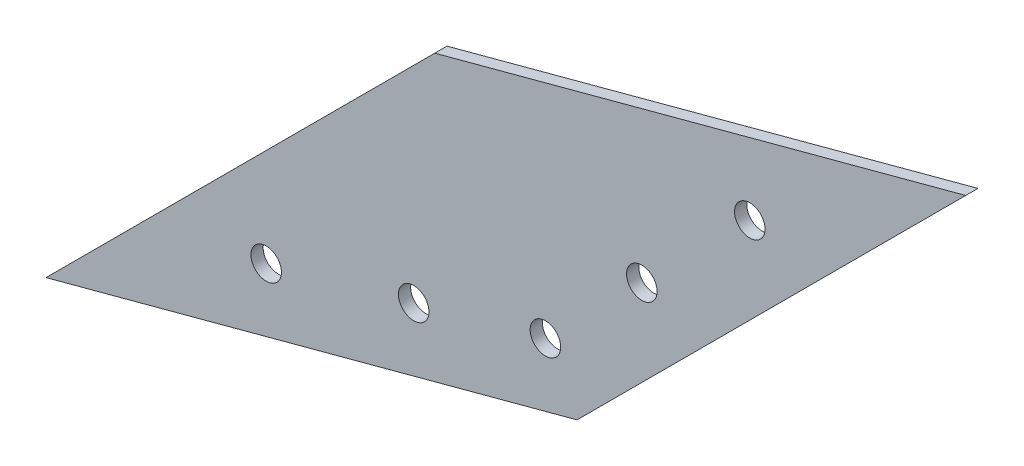
ISO-10303-21;
HEADER;
FILE_DESCRIPTION(('STEP AP214'),'2;1');
FILE_NAME('part.step','',(''),(''),'','','');
FILE_SCHEMA(('AUTOMOTIVE_DESIGN { 1 0 10303 214 1 1 1 1 }'));
ENDSEC;
DATA;
#1=APPLICATION_CONTEXT('core data for automotive mechanical design processes');
#2=APPLICATION_PROTOCOL_DEFINITION('international standard','automotive_design',2000,#1);
#3=PRODUCT_CONTEXT('',#1,'mechanical');
#4=PRODUCT('Part','Part','',(#3));
#5=PRODUCT_RELATED_PRODUCT_CATEGORY('part','',(#4));
#6=PRODUCT_DEFINITION_FORMATION('','',#4);
#7=PRODUCT_DEFINITION_CONTEXT('part definition',#1,'design');
#8=PRODUCT_DEFINITION('design','',#6,#7);
#9=PRODUCT_DEFINITION_SHAPE('','',#8);
#10=(LENGTH_UNIT() NAMED_UNIT(*) SI_UNIT(.MILLI.,.METRE.));
#11=(NAMED_UNIT(*) PLANE_ANGLE_UNIT() SI_UNIT($,.RADIAN.));
#12=(NAMED_UNIT(*) SI_UNIT($,.STERADIAN.) SOLID_ANGLE_UNIT());
#13=UNCERTAINTY_MEASURE_WITH_UNIT(LENGTH_MEASURE(1.E-05),#10,'distance_accuracy_value','');
#14=(GEOMETRIC_REPRESENTATION_CONTEXT(3) GLOBAL_UNCERTAINTY_ASSIGNED_CONTEXT((#13)) GLOBAL_UNIT_ASSIGNED_CONTEXT((#10,
#11,#12)) REPRESENTATION_CONTEXT('',''));
#15=CARTESIAN_POINT('',(0.,0.,0.));
#16=DIRECTION('',(0.,0.,1.));
#17=DIRECTION('',(1.,0.,0.));
#18=AXIS2_PLACEMENT_3D('',#15,#16,#17);
#19=CARTESIAN_POINT('',(0.,0.,2.));
#20=DIRECTION('',(-0.258819045102518,0.965925826289069,0.));
#21=DIRECTION('',(-0.965925826289069,-0.258819045102518,0.));
#22=AXIS2_PLACEMENT_3D('',#19,#20,#21);
#23=PLANE('',#22);
#24=DIRECTION('',(0.965925826289069,0.258819045102518,0.));
#25=VECTOR('',#24,1.);
#26=CARTESIAN_POINT('',(0.,0.,0.));
#27=LINE('',#26,#25);
#28=CARTESIAN_POINT('',(0.,0.,0.));
#29=VERTEX_POINT('',#28);
#30=CARTESIAN_POINT('',(86.9333243660162,23.2937140592266,0.));
#31=VERTEX_POINT('',#30);
#32=EDGE_CURVE('E97',#29,#31,#27,.T.);
#33=ORIENTED_EDGE('',*,*,#32,.T.);
#34=DIRECTION('',(0.,0.,-1.));
#35=VECTOR('',#34,1.);
#36=CARTESIAN_POINT('',(86.9333243660162,23.2937140592266,2.));
#37=LINE('',#36,#35);
#38=CARTESIAN_POINT('',(86.9333243660162,23.2937140592266,2.));
#39=VERTEX_POINT('',#38);
#40=EDGE_CURVE('E11',#39,#31,#37,.T.);
#41=ORIENTED_EDGE('',*,*,#40,.F.);
#42=DIRECTION('',(0.965925826289069,0.258819045102518,0.));
#43=VECTOR('',#42,1.);
#44=CARTESIAN_POINT('',(0.,0.,2.));
#45=LINE('',#44,#43);
#46=CARTESIAN_POINT('',(0.,0.,2.));
#47=VERTEX_POINT('',#46);
#48=EDGE_CURVE('E85',#47,#39,#45,.T.);
#49=ORIENTED_EDGE('',*,*,#48,.F.);
#50=DIRECTION('',(0.,0.,-1.));
#51=VECTOR('',#50,1.);
#52=CARTESIAN_POINT('',(0.,0.,2.));
#53=LINE('',#52,#51);
#54=EDGE_CURVE('E93',#47,#29,#53,.T.);
#55=ORIENTED_EDGE('',*,*,#54,.T.);
#56=EDGE_LOOP('',(#33,#41,#49,#55));
#57=FACE_BOUND('',#56,.T.);
#58=ADVANCED_FACE('F34',(#57),#23,.F.);
#59=CARTESIAN_POINT('',(86.9333243660162,23.2937140592266,2.));
#60=DIRECTION('',(-0.707106781186547,0.707106781186549,0.));
#61=DIRECTION('',(-0.707106781186549,-0.707106781186546,0.));
#62=AXIS2_PLACEMENT_3D('',#59,#60,#61);
#63=PLANE('',#62);
#64=DIRECTION('',(0.707106781186548,0.707106781186546,0.));
#65=VECTOR('',#64,1.);
#66=CARTESIAN_POINT('',(86.9333243660162,23.2937140592266,0.));
#67=LINE('',#66,#65);
#68=CARTESIAN_POINT('',(150.572934672806,86.9333243660158,0.));
#69=VERTEX_POINT('',#68);
#70=EDGE_CURVE('E89',#31,#69,#67,.T.);
#71=ORIENTED_EDGE('',*,*,#70,.T.);
#72=DIRECTION('',(0.,0.,-1.));
#73=VECTOR('',#72,1.);
#74=CARTESIAN_POINT('',(150.572934672806,86.9333243660158,2.));
#75=LINE('',#74,#73);
#76=CARTESIAN_POINT('',(150.572934672806,86.9333243660158,2.));
#77=VERTEX_POINT('',#76);
#78=EDGE_CURVE('E42',#77,#69,#75,.T.);
#79=ORIENTED_EDGE('',*,*,#78,.F.);
#80=DIRECTION('',(0.707106781186548,0.707106781186546,0.));
#81=VECTOR('',#80,1.);
#82=CARTESIAN_POINT('',(86.9333243660162,23.2937140592266,2.));
#83=LINE('',#82,#81);
#84=EDGE_CURVE('E80',#39,#77,#83,.T.);
#85=ORIENTED_EDGE('',*,*,#84,.F.);
#86=ORIENTED_EDGE('',*,*,#40,.T.);
#87=EDGE_LOOP('',(#71,#79,#85,#86));
#88=FACE_BOUND('',#87,.T.);
#89=ADVANCED_FACE('F88',(#88),#63,.F.);
#90=CARTESIAN_POINT('',(63.6396103067894,63.6396103067892,2.));
#91=DIRECTION('',(0.258819045102518,-0.965925826289069,0.));
#92=DIRECTION('',(0.965925826289069,0.258819045102518,0.));
#93=AXIS2_PLACEMENT_3D('',#90,#91,#92);
#94=PLANE('',#93);
#95=DIRECTION('',(-0.965925826289069,-0.258819045102518,0.));
#96=VECTOR('',#95,1.);
#97=CARTESIAN_POINT('',(63.6396103067894,63.6396103067892,0.));
#98=LINE('',#97,#96);
#99=CARTESIAN_POINT('',(63.6396103067894,63.6396103067892,0.));
#100=VERTEX_POINT('',#99);
#101=EDGE_CURVE('E67',#69,#100,#98,.T.);
#102=ORIENTED_EDGE('',*,*,#101,.T.);
#103=DIRECTION('',(0.,0.,-1.));
#104=VECTOR('',#103,1.);
#105=CARTESIAN_POINT('',(63.6396103067894,63.6396103067892,2.));
#106=LINE('',#105,#104);
#107=CARTESIAN_POINT('',(63.6396103067894,63.6396103067892,2.));
#108=VERTEX_POINT('',#107);
#109=EDGE_CURVE('E90',#108,#100,#106,.T.);
#110=ORIENTED_EDGE('',*,*,#109,.F.);
#111=DIRECTION('',(-0.965925826289069,-0.258819045102518,0.));
#112=VECTOR('',#111,1.);
#113=CARTESIAN_POINT('',(63.6396103067894,63.6396103067892,2.));
#114=LINE('',#113,#112);
#115=EDGE_CURVE('E83',#77,#108,#114,.T.);
#116=ORIENTED_EDGE('',*,*,#115,.F.);
#117=ORIENTED_EDGE('',*,*,#78,.T.);
#118=EDGE_LOOP('',(#102,#110,#116,#117));
#119=FACE_BOUND('',#118,.T.);
#120=ADVANCED_FACE('F91',(#119),#94,.F.);
#121=CARTESIAN_POINT('',(0.,0.,2.));
#122=DIRECTION('',(0.707106781186547,-0.707106781186548,0.));
#123=DIRECTION('',(0.707106781186548,0.707106781186547,0.));
#124=AXIS2_PLACEMENT_3D('',#121,#122,#123);
#125=PLANE('',#124);
#126=DIRECTION('',(-0.707106781186548,-0.707106781186547,0.));
#127=VECTOR('',#126,1.);
#128=CARTESIAN_POINT('',(0.,0.,0.));
#129=LINE('',#128,#127);
#130=EDGE_CURVE('E73',#100,#29,#129,.T.);
#131=ORIENTED_EDGE('',*,*,#130,.T.);
#132=ORIENTED_EDGE('',*,*,#54,.F.);
#133=DIRECTION('',(-0.707106781186548,-0.707106781186547,0.));
#134=VECTOR('',#133,1.);
#135=CARTESIAN_POINT('',(0.,0.,2.));
#136=LINE('',#135,#134);
#137=EDGE_CURVE('E50',#108,#47,#136,.T.);
#138=ORIENTED_EDGE('',*,*,#137,.F.);
#139=ORIENTED_EDGE('',*,*,#109,.T.);
#140=EDGE_LOOP('',(#131,#132,#138,#139));
#141=FACE_BOUND('',#140,.T.);
#142=ADVANCED_FACE('F105',(#141),#125,.F.);
#143=CARTESIAN_POINT('',(0.,0.,2.));
#144=DIRECTION('',(0.,0.,1.));
#145=DIRECTION('',(1.,0.,0.));
#146=AXIS2_PLACEMENT_3D('',#143,#144,#145);
#147=PLANE('',#146);
#148=CARTESIAN_POINT('',(81.7569434639658,32.2594687809072,2.));
#149=DIRECTION('',(0.,0.,1.));
#150=DIRECTION('',(1.,0.,0.));
#151=AXIS2_PLACEMENT_3D('',#148,#149,#150);
#152=CIRCLE('',#151,2.5);
#153=CARTESIAN_POINT('',(84.2569434639658,32.2594687809072,2.));
#154=VERTEX_POINT('',#153);
#155=EDGE_CURVE('E135',#154,#154,#152,.T.);
#156=ORIENTED_EDGE('',*,*,#155,.F.);
#157=EDGE_LOOP('',(#156));
#158=FACE_BOUND('',#157,.T.);
#159=CARTESIAN_POINT('',(36.0488426005376,20.0120200669914,2.));
#160=DIRECTION('',(0.,0.,1.));
#161=DIRECTION('',(1.,0.,0.));
#162=AXIS2_PLACEMENT_3D('',#159,#160,#161);
#163=CIRCLE('',#162,2.5);
#164=CARTESIAN_POINT('',(38.5488426005376,20.0120200669914,2.));
#165=VERTEX_POINT('',#164);
#166=EDGE_CURVE('E129',#165,#165,#163,.T.);
#167=ORIENTED_EDGE('',*,*,#166,.F.);
#168=EDGE_LOOP('',(#167));
#169=FACE_BOUND('',#168,.T.);
#170=CARTESIAN_POINT('',(60.1969882577643,26.4824961945544,2.));
#171=DIRECTION('',(0.,0.,1.));
#172=DIRECTION('',(1.,0.,0.));
#173=AXIS2_PLACEMENT_3D('',#170,#171,#172);
#174=CIRCLE('',#173,2.50000000000001);
#175=CARTESIAN_POINT('',(62.6969882577643,26.4824961945544,2.));
#176=VERTEX_POINT('',#175);
#177=EDGE_CURVE('E123',#176,#176,#174,.T.);
#178=ORIENTED_EDGE('',*,*,#177,.F.);
#179=EDGE_LOOP('',(#178));
#180=FACE_BOUND('',#179,.T.);
#181=CARTESIAN_POINT('',(97.5399260838144,48.0424514007558,2.));
#182=DIRECTION('',(0.,0.,1.));
#183=DIRECTION('',(1.,0.,0.));
#184=AXIS2_PLACEMENT_3D('',#181,#182,#183);
#185=CIRCLE('',#184,2.5);
#186=CARTESIAN_POINT('',(100.039926083814,48.0424514007558,2.));
#187=VERTEX_POINT('',#186);
#188=EDGE_CURVE('E117',#187,#187,#185,.T.);
#189=ORIENTED_EDGE('',*,*,#188,.F.);
#190=EDGE_LOOP('',(#189));
#191=FACE_BOUND('',#190,.T.);
#192=CARTESIAN_POINT('',(115.217595613478,65.7201209304195,2.));
#193=DIRECTION('',(0.,0.,1.));
#194=DIRECTION('',(1.,0.,0.));
#195=AXIS2_PLACEMENT_3D('',#192,#193,#194);
#196=CIRCLE('',#195,2.50000000000001);
#197=CARTESIAN_POINT('',(117.717595613478,65.7201209304195,2.));
#198=VERTEX_POINT('',#197);
#199=EDGE_CURVE('E111',#198,#198,#196,.T.);
#200=ORIENTED_EDGE('',*,*,#199,.F.);
#201=EDGE_LOOP('',(#200));
#202=FACE_BOUND('',#201,.T.);
#203=ORIENTED_EDGE('',*,*,#48,.T.);
#204=ORIENTED_EDGE('',*,*,#84,.T.);
#205=ORIENTED_EDGE('',*,*,#115,.T.);
#206=ORIENTED_EDGE('',*,*,#137,.T.);
#207=EDGE_LOOP('',(#203,#204,#205,#206));
#208=FACE_BOUND('',#207,.T.);
#209=ADVANCED_FACE('F81',(#158,#169,#180,#191,#202,#208),#147,.T.);
#210=CARTESIAN_POINT('',(0.,0.,0.));
#211=DIRECTION('',(0.,0.,1.));
#212=DIRECTION('',(1.,0.,0.));
#213=AXIS2_PLACEMENT_3D('',#210,#211,#212);
#214=PLANE('',#213);
#215=CARTESIAN_POINT('',(81.7569434639658,32.2594687809072,0.));
#216=DIRECTION('',(0.,0.,1.));
#217=DIRECTION('',(1.,0.,0.));
#218=AXIS2_PLACEMENT_3D('',#215,#216,#217);
#219=CIRCLE('',#218,2.5);
#220=CARTESIAN_POINT('',(84.2569434639658,32.2594687809072,0.));
#221=VERTEX_POINT('',#220);
#222=EDGE_CURVE('E132',#221,#221,#219,.T.);
#223=ORIENTED_EDGE('',*,*,#222,.T.);
#224=EDGE_LOOP('',(#223));
#225=FACE_BOUND('',#224,.T.);
#226=CARTESIAN_POINT('',(36.0488426005376,20.0120200669914,0.));
#227=DIRECTION('',(0.,0.,1.));
#228=DIRECTION('',(1.,0.,0.));
#229=AXIS2_PLACEMENT_3D('',#226,#227,#228);
#230=CIRCLE('',#229,2.5);
#231=CARTESIAN_POINT('',(38.5488426005376,20.0120200669914,0.));
#232=VERTEX_POINT('',#231);
#233=EDGE_CURVE('E126',#232,#232,#230,.T.);
#234=ORIENTED_EDGE('',*,*,#233,.T.);
#235=EDGE_LOOP('',(#234));
#236=FACE_BOUND('',#235,.T.);
#237=CARTESIAN_POINT('',(60.1969882577643,26.4824961945544,0.));
#238=DIRECTION('',(0.,0.,1.));
#239=DIRECTION('',(1.,0.,0.));
#240=AXIS2_PLACEMENT_3D('',#237,#238,#239);
#241=CIRCLE('',#240,2.50000000000001);
#242=CARTESIAN_POINT('',(62.6969882577643,26.4824961945544,0.));
#243=VERTEX_POINT('',#242);
#244=EDGE_CURVE('E120',#243,#243,#241,.T.);
#245=ORIENTED_EDGE('',*,*,#244,.T.);
#246=EDGE_LOOP('',(#245));
#247=FACE_BOUND('',#246,.T.);
#248=CARTESIAN_POINT('',(97.5399260838144,48.0424514007558,0.));
#249=DIRECTION('',(0.,0.,1.));
#250=DIRECTION('',(1.,0.,0.));
#251=AXIS2_PLACEMENT_3D('',#248,#249,#250);
#252=CIRCLE('',#251,2.5);
#253=CARTESIAN_POINT('',(100.039926083814,48.0424514007558,0.));
#254=VERTEX_POINT('',#253);
#255=EDGE_CURVE('E114',#254,#254,#252,.T.);
#256=ORIENTED_EDGE('',*,*,#255,.T.);
#257=EDGE_LOOP('',(#256));
#258=FACE_BOUND('',#257,.T.);
#259=CARTESIAN_POINT('',(115.217595613478,65.7201209304195,0.));
#260=DIRECTION('',(0.,0.,1.));
#261=DIRECTION('',(1.,0.,0.));
#262=AXIS2_PLACEMENT_3D('',#259,#260,#261);
#263=CIRCLE('',#262,2.50000000000001);
#264=CARTESIAN_POINT('',(117.717595613478,65.7201209304195,0.));
#265=VERTEX_POINT('',#264);
#266=EDGE_CURVE('E100',#265,#265,#263,.T.);
#267=ORIENTED_EDGE('',*,*,#266,.T.);
#268=EDGE_LOOP('',(#267));
#269=FACE_BOUND('',#268,.T.);
#270=ORIENTED_EDGE('',*,*,#32,.F.);
#271=ORIENTED_EDGE('',*,*,#130,.F.);
#272=ORIENTED_EDGE('',*,*,#101,.F.);
#273=ORIENTED_EDGE('',*,*,#70,.F.);
#274=EDGE_LOOP('',(#270,#271,#272,#273));
#275=FACE_BOUND('',#274,.T.);
#276=ADVANCED_FACE('F108',(#225,#236,#247,#258,#269,#275),#214,.F.);
#277=CARTESIAN_POINT('',(115.217595613478,65.7201209304195,0.));
#278=DIRECTION('',(0.,0.,1.));
#279=DIRECTION('',(1.,0.,0.));
#280=AXIS2_PLACEMENT_3D('',#277,#278,#279);
#281=CYLINDRICAL_SURFACE('',#280,2.50000000000001);
#282=ORIENTED_EDGE('',*,*,#266,.F.);
#283=EDGE_LOOP('',(#282));
#284=FACE_BOUND('',#283,.T.);
#285=ORIENTED_EDGE('',*,*,#199,.T.);
#286=EDGE_LOOP('',(#285));
#287=FACE_BOUND('',#286,.T.);
#288=ADVANCED_FACE('F161',(#284,#287),#281,.F.);
#289=CARTESIAN_POINT('',(97.5399260838144,48.0424514007558,0.));
#290=DIRECTION('',(0.,0.,1.));
#291=DIRECTION('',(1.,0.,0.));
#292=AXIS2_PLACEMENT_3D('',#289,#290,#291);
#293=CYLINDRICAL_SURFACE('',#292,2.5);
#294=ORIENTED_EDGE('',*,*,#255,.F.);
#295=EDGE_LOOP('',(#294));
#296=FACE_BOUND('',#295,.T.);
#297=ORIENTED_EDGE('',*,*,#188,.T.);
#298=EDGE_LOOP('',(#297));
#299=FACE_BOUND('',#298,.T.);
#300=ADVANCED_FACE('F163',(#296,#299),#293,.F.);
#301=CARTESIAN_POINT('',(60.1969882577643,26.4824961945544,0.));
#302=DIRECTION('',(0.,0.,1.));
#303=DIRECTION('',(1.,0.,0.));
#304=AXIS2_PLACEMENT_3D('',#301,#302,#303);
#305=CYLINDRICAL_SURFACE('',#304,2.50000000000001);
#306=ORIENTED_EDGE('',*,*,#244,.F.);
#307=EDGE_LOOP('',(#306));
#308=FACE_BOUND('',#307,.T.);
#309=ORIENTED_EDGE('',*,*,#177,.T.);
#310=EDGE_LOOP('',(#309));
#311=FACE_BOUND('',#310,.T.);
#312=ADVANCED_FACE('F170',(#308,#311),#305,.F.);
#313=CARTESIAN_POINT('',(36.0488426005376,20.0120200669914,0.));
#314=DIRECTION('',(0.,0.,1.));
#315=DIRECTION('',(1.,0.,0.));
#316=AXIS2_PLACEMENT_3D('',#313,#314,#315);
#317=CYLINDRICAL_SURFACE('',#316,2.5);
#318=ORIENTED_EDGE('',*,*,#233,.F.);
#319=EDGE_LOOP('',(#318));
#320=FACE_BOUND('',#319,.T.);
#321=ORIENTED_EDGE('',*,*,#166,.T.);
#322=EDGE_LOOP('',(#321));
#323=FACE_BOUND('',#322,.T.);
#324=ADVANCED_FACE('F146',(#320,#323),#317,.F.);
#325=CARTESIAN_POINT('',(81.7569434639658,32.2594687809072,0.));
#326=DIRECTION('',(0.,0.,1.));
#327=DIRECTION('',(1.,0.,0.));
#328=AXIS2_PLACEMENT_3D('',#325,#326,#327);
#329=CYLINDRICAL_SURFACE('',#328,2.5);
#330=ORIENTED_EDGE('',*,*,#222,.F.);
#331=EDGE_LOOP('',(#330));
#332=FACE_BOUND('',#331,.T.);
#333=ORIENTED_EDGE('',*,*,#155,.T.);
#334=EDGE_LOOP('',(#333));
#335=FACE_BOUND('',#334,.T.);
#336=ADVANCED_FACE('F143',(#332,#335),#329,.F.);
#337=CLOSED_SHELL('',(#58,#89,#120,#142,#209,#276,#288,#300,#312,#324,#336));
#338=MANIFOLD_SOLID_BREP('B2',#337);
#339=ADVANCED_BREP_SHAPE_REPRESENTATION('',(#18,#338),#14);
#340=SHAPE_DEFINITION_REPRESENTATION(#9,#339);
ENDSEC;
END-ISO-10303-21;
